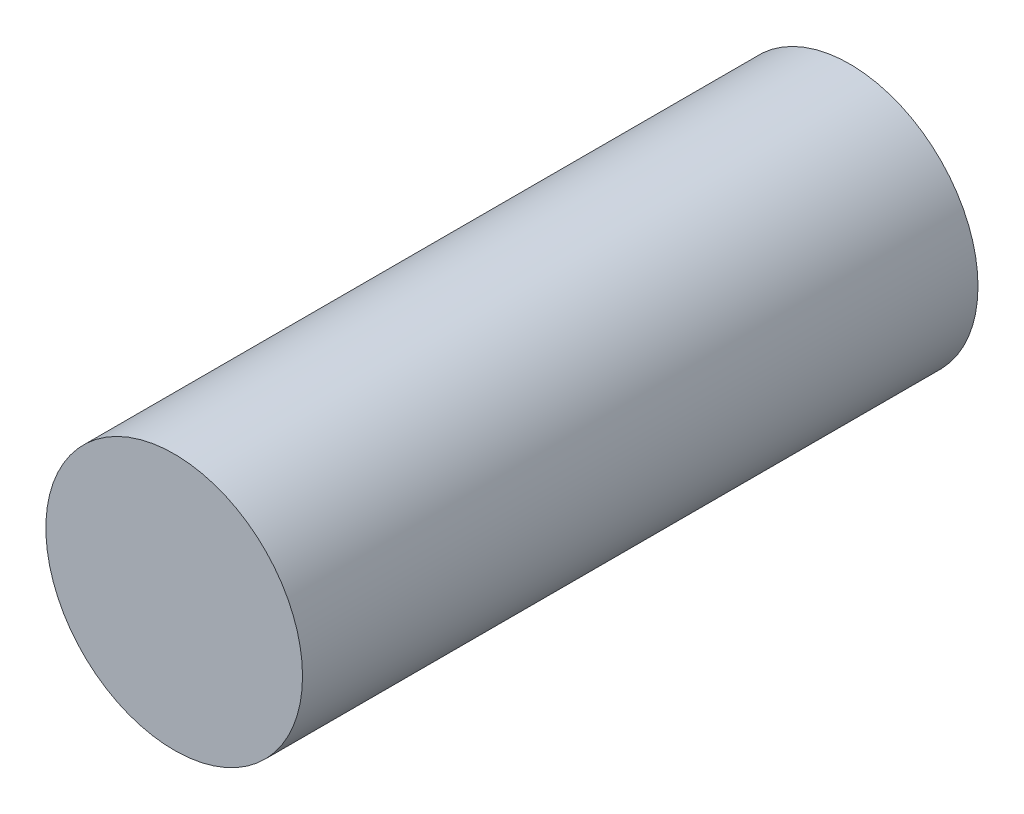
ISO-10303-21;
HEADER;
FILE_DESCRIPTION(('STEP AP214'),'2;1');
FILE_NAME('part.step','',(''),(''),'','','');
FILE_SCHEMA(('AUTOMOTIVE_DESIGN { 1 0 10303 214 1 1 1 1 }'));
ENDSEC;
DATA;
#1=APPLICATION_CONTEXT('core data for automotive mechanical design processes');
#2=APPLICATION_PROTOCOL_DEFINITION('international standard','automotive_design',2000,#1);
#3=PRODUCT_CONTEXT('',#1,'mechanical');
#4=PRODUCT('Part','Part','',(#3));
#5=PRODUCT_RELATED_PRODUCT_CATEGORY('part','',(#4));
#6=PRODUCT_DEFINITION_FORMATION('','',#4);
#7=PRODUCT_DEFINITION_CONTEXT('part definition',#1,'design');
#8=PRODUCT_DEFINITION('design','',#6,#7);
#9=PRODUCT_DEFINITION_SHAPE('','',#8);
#10=(LENGTH_UNIT() NAMED_UNIT(*) SI_UNIT(.MILLI.,.METRE.));
#11=(NAMED_UNIT(*) PLANE_ANGLE_UNIT() SI_UNIT($,.RADIAN.));
#12=(NAMED_UNIT(*) SI_UNIT($,.STERADIAN.) SOLID_ANGLE_UNIT());
#13=UNCERTAINTY_MEASURE_WITH_UNIT(LENGTH_MEASURE(1.E-05),#10,'distance_accuracy_value','');
#14=(GEOMETRIC_REPRESENTATION_CONTEXT(3) GLOBAL_UNCERTAINTY_ASSIGNED_CONTEXT((#13)) GLOBAL_UNIT_ASSIGNED_CONTEXT((#10,
#11,#12)) REPRESENTATION_CONTEXT('',''));
#15=CARTESIAN_POINT('',(0.,0.,0.));
#16=DIRECTION('',(0.,0.,1.));
#17=DIRECTION('',(1.,0.,0.));
#18=AXIS2_PLACEMENT_3D('',#15,#16,#17);
#19=CARTESIAN_POINT('',(0.,0.,25.));
#20=DIRECTION('',(0.,0.,-1.));
#21=DIRECTION('',(-1.,0.,0.));
#22=AXIS2_PLACEMENT_3D('',#19,#20,#21);
#23=CYLINDRICAL_SURFACE('',#22,4.75);
#24=CARTESIAN_POINT('',(0.,0.,25.));
#25=DIRECTION('',(0.,0.,1.));
#26=DIRECTION('',(1.,0.,0.));
#27=AXIS2_PLACEMENT_3D('',#24,#25,#26);
#28=CIRCLE('',#27,4.75);
#29=CARTESIAN_POINT('',(4.75,0.,25.));
#30=VERTEX_POINT('',#29);
#31=EDGE_CURVE('E10',#30,#30,#28,.T.);
#32=ORIENTED_EDGE('',*,*,#31,.F.);
#33=EDGE_LOOP('',(#32));
#34=FACE_BOUND('',#33,.T.);
#35=CARTESIAN_POINT('',(0.,0.,0.));
#36=DIRECTION('',(0.,0.,1.));
#37=DIRECTION('',(1.,0.,0.));
#38=AXIS2_PLACEMENT_3D('',#35,#36,#37);
#39=CIRCLE('',#38,4.75);
#40=CARTESIAN_POINT('',(4.75,0.,0.));
#41=VERTEX_POINT('',#40);
#42=EDGE_CURVE('E44',#41,#41,#39,.T.);
#43=ORIENTED_EDGE('',*,*,#42,.T.);
#44=EDGE_LOOP('',(#43));
#45=FACE_BOUND('',#44,.T.);
#46=ADVANCED_FACE('F41',(#34,#45),#23,.T.);
#47=CARTESIAN_POINT('',(0.,0.,25.));
#48=DIRECTION('',(0.,0.,1.));
#49=DIRECTION('',(1.,0.,0.));
#50=AXIS2_PLACEMENT_3D('',#47,#48,#49);
#51=PLANE('',#50);
#52=ORIENTED_EDGE('',*,*,#31,.T.);
#53=EDGE_LOOP('',(#52));
#54=FACE_BOUND('',#53,.T.);
#55=ADVANCED_FACE('F56',(#54),#51,.T.);
#56=CARTESIAN_POINT('',(0.,0.,0.));
#57=DIRECTION('',(0.,0.,1.));
#58=DIRECTION('',(1.,0.,0.));
#59=AXIS2_PLACEMENT_3D('',#56,#57,#58);
#60=PLANE('',#59);
#61=ORIENTED_EDGE('',*,*,#42,.F.);
#62=EDGE_LOOP('',(#61));
#63=FACE_BOUND('',#62,.T.);
#64=ADVANCED_FACE('F54',(#63),#60,.F.);
#65=CLOSED_SHELL('',(#46,#55,#64));
#66=MANIFOLD_SOLID_BREP('B2',#65);
#67=ADVANCED_BREP_SHAPE_REPRESENTATION('',(#18,#66),#14);
#68=SHAPE_DEFINITION_REPRESENTATION(#9,#67);
ENDSEC;
END-ISO-10303-21;
